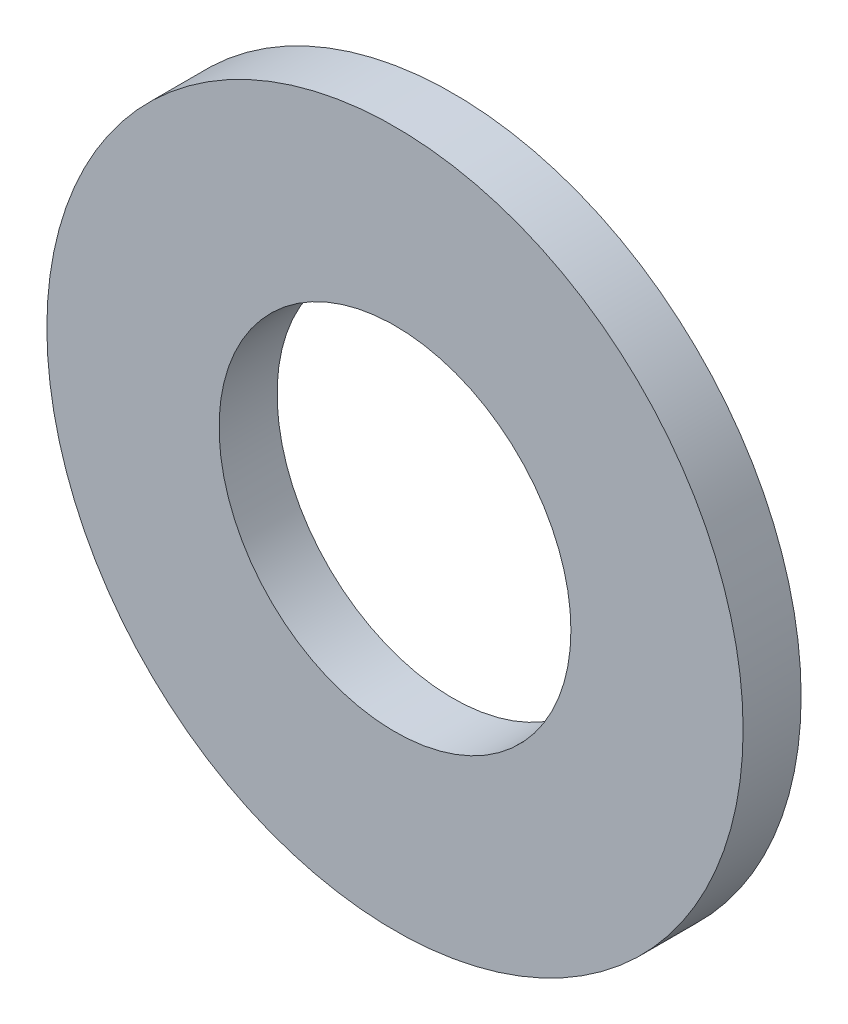
ISO-10303-21;
HEADER;
FILE_DESCRIPTION(('STEP AP214'),'2;1');
FILE_NAME('part.step','',(''),(''),'','','');
FILE_SCHEMA(('AUTOMOTIVE_DESIGN { 1 0 10303 214 1 1 1 1 }'));
ENDSEC;
DATA;
#1=APPLICATION_CONTEXT('core data for automotive mechanical design processes');
#2=APPLICATION_PROTOCOL_DEFINITION('international standard','automotive_design',2000,#1);
#3=PRODUCT_CONTEXT('',#1,'mechanical');
#4=PRODUCT('Part','Part','',(#3));
#5=PRODUCT_RELATED_PRODUCT_CATEGORY('part','',(#4));
#6=PRODUCT_DEFINITION_FORMATION('','',#4);
#7=PRODUCT_DEFINITION_CONTEXT('part definition',#1,'design');
#8=PRODUCT_DEFINITION('design','',#6,#7);
#9=PRODUCT_DEFINITION_SHAPE('','',#8);
#10=(LENGTH_UNIT() NAMED_UNIT(*) SI_UNIT(.MILLI.,.METRE.));
#11=(NAMED_UNIT(*) PLANE_ANGLE_UNIT() SI_UNIT($,.RADIAN.));
#12=(NAMED_UNIT(*) SI_UNIT($,.STERADIAN.) SOLID_ANGLE_UNIT());
#13=UNCERTAINTY_MEASURE_WITH_UNIT(LENGTH_MEASURE(1.E-05),#10,'distance_accuracy_value','');
#14=(GEOMETRIC_REPRESENTATION_CONTEXT(3) GLOBAL_UNCERTAINTY_ASSIGNED_CONTEXT((#13)) GLOBAL_UNIT_ASSIGNED_CONTEXT((#10,
#11,#12)) REPRESENTATION_CONTEXT('',''));
#15=CARTESIAN_POINT('',(0.,0.,0.));
#16=DIRECTION('',(0.,0.,1.));
#17=DIRECTION('',(1.,0.,0.));
#18=AXIS2_PLACEMENT_3D('',#15,#16,#17);
#19=CARTESIAN_POINT('',(0.,0.,0.79375));
#20=DIRECTION('',(0.,0.,1.));
#21=DIRECTION('',(1.,0.,0.));
#22=AXIS2_PLACEMENT_3D('',#19,#20,#21);
#23=PLANE('',#22);
#24=CARTESIAN_POINT('',(0.,0.,0.79375));
#25=DIRECTION('',(0.,0.,1.));
#26=DIRECTION('',(1.,0.,0.));
#27=AXIS2_PLACEMENT_3D('',#24,#25,#26);
#28=CIRCLE('',#27,9.525);
#29=CARTESIAN_POINT('',(9.525,0.,0.79375));
#30=VERTEX_POINT('',#29);
#31=EDGE_CURVE('E10',#30,#30,#28,.T.);
#32=ORIENTED_EDGE('',*,*,#31,.T.);
#33=EDGE_LOOP('',(#32));
#34=FACE_BOUND('',#33,.T.);
#35=CARTESIAN_POINT('',(0.,0.,0.79375));
#36=DIRECTION('',(0.,0.,1.));
#37=DIRECTION('',(1.,0.,0.));
#38=AXIS2_PLACEMENT_3D('',#35,#36,#37);
#39=CIRCLE('',#38,4.8133);
#40=CARTESIAN_POINT('',(4.8133,0.,0.79375));
#41=VERTEX_POINT('',#40);
#42=EDGE_CURVE('E41',#41,#41,#39,.T.);
#43=ORIENTED_EDGE('',*,*,#42,.F.);
#44=EDGE_LOOP('',(#43));
#45=FACE_BOUND('',#44,.T.);
#46=ADVANCED_FACE('F30',(#34,#45),#23,.T.);
#47=CARTESIAN_POINT('',(0.,0.,-0.79375));
#48=DIRECTION('',(0.,0.,1.));
#49=DIRECTION('',(1.,0.,0.));
#50=AXIS2_PLACEMENT_3D('',#47,#48,#49);
#51=PLANE('',#50);
#52=CARTESIAN_POINT('',(0.,0.,-0.79375));
#53=DIRECTION('',(0.,0.,1.));
#54=DIRECTION('',(1.,0.,0.));
#55=AXIS2_PLACEMENT_3D('',#52,#53,#54);
#56=CIRCLE('',#55,9.525);
#57=CARTESIAN_POINT('',(9.525,0.,-0.79375));
#58=VERTEX_POINT('',#57);
#59=EDGE_CURVE('E34',#58,#58,#56,.T.);
#60=ORIENTED_EDGE('',*,*,#59,.F.);
#61=EDGE_LOOP('',(#60));
#62=FACE_BOUND('',#61,.T.);
#63=CARTESIAN_POINT('',(0.,0.,-0.79375));
#64=DIRECTION('',(0.,0.,1.));
#65=DIRECTION('',(1.,0.,0.));
#66=AXIS2_PLACEMENT_3D('',#63,#64,#65);
#67=CIRCLE('',#66,4.8133);
#68=CARTESIAN_POINT('',(4.8133,0.,-0.79375));
#69=VERTEX_POINT('',#68);
#70=EDGE_CURVE('E43',#69,#69,#67,.T.);
#71=ORIENTED_EDGE('',*,*,#70,.T.);
#72=EDGE_LOOP('',(#71));
#73=FACE_BOUND('',#72,.T.);
#74=ADVANCED_FACE('F53',(#62,#73),#51,.F.);
#75=CARTESIAN_POINT('',(0.,0.,0.79375));
#76=DIRECTION('',(0.,0.,-1.));
#77=DIRECTION('',(-1.,0.,0.));
#78=AXIS2_PLACEMENT_3D('',#75,#76,#77);
#79=CYLINDRICAL_SURFACE('',#78,9.525);
#80=ORIENTED_EDGE('',*,*,#31,.F.);
#81=EDGE_LOOP('',(#80));
#82=FACE_BOUND('',#81,.T.);
#83=ORIENTED_EDGE('',*,*,#59,.T.);
#84=EDGE_LOOP('',(#83));
#85=FACE_BOUND('',#84,.T.);
#86=ADVANCED_FACE('F32',(#82,#85),#79,.T.);
#87=CARTESIAN_POINT('',(0.,0.,0.79375));
#88=DIRECTION('',(0.,0.,-1.));
#89=DIRECTION('',(-1.,0.,0.));
#90=AXIS2_PLACEMENT_3D('',#87,#88,#89);
#91=CYLINDRICAL_SURFACE('',#90,4.8133);
#92=ORIENTED_EDGE('',*,*,#42,.T.);
#93=EDGE_LOOP('',(#92));
#94=FACE_BOUND('',#93,.T.);
#95=ORIENTED_EDGE('',*,*,#70,.F.);
#96=EDGE_LOOP('',(#95));
#97=FACE_BOUND('',#96,.T.);
#98=ADVANCED_FACE('F49',(#94,#97),#91,.F.);
#99=CLOSED_SHELL('',(#46,#74,#86,#98));
#100=MANIFOLD_SOLID_BREP('B2',#99);
#101=ADVANCED_BREP_SHAPE_REPRESENTATION('',(#18,#100),#14);
#102=SHAPE_DEFINITION_REPRESENTATION(#9,#101);
ENDSEC;
END-ISO-10303-21;
